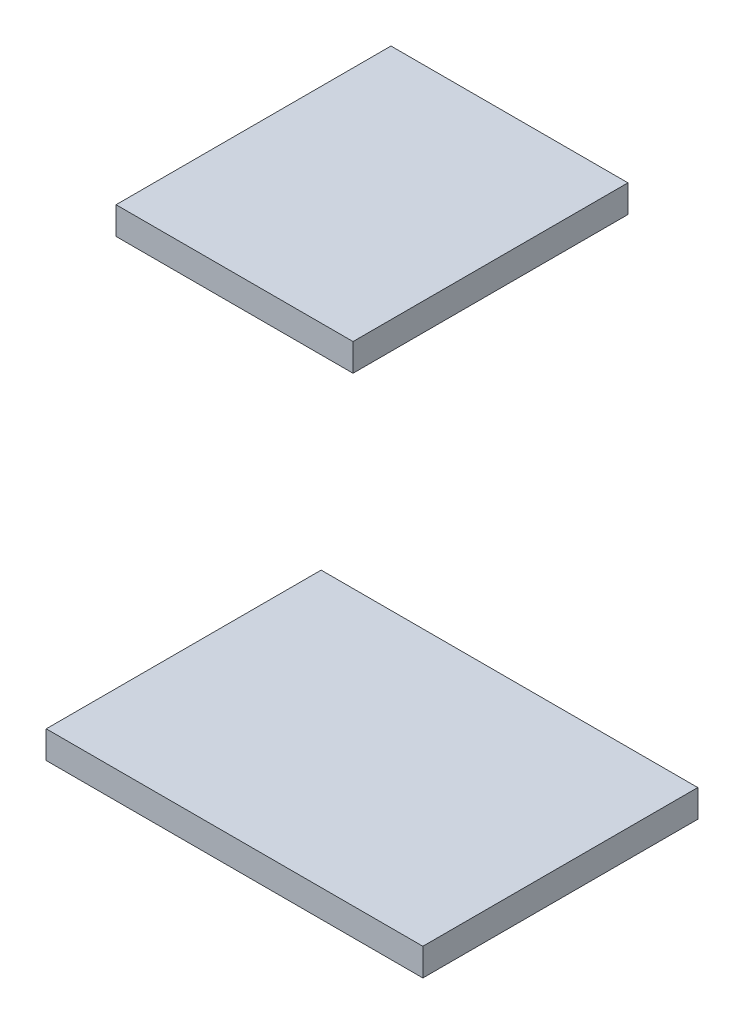
ISO-10303-21;
HEADER;
FILE_DESCRIPTION(('STEP AP214'),'2;1');
FILE_NAME('part.step','',(''),(''),'','','');
FILE_SCHEMA(('AUTOMOTIVE_DESIGN { 1 0 10303 214 1 1 1 1 }'));
ENDSEC;
DATA;
#1=APPLICATION_CONTEXT('core data for automotive mechanical design processes');
#2=APPLICATION_PROTOCOL_DEFINITION('international standard','automotive_design',2000,#1);
#3=PRODUCT_CONTEXT('',#1,'mechanical');
#4=PRODUCT('Part','Part','',(#3));
#5=PRODUCT_RELATED_PRODUCT_CATEGORY('part','',(#4));
#6=PRODUCT_DEFINITION_FORMATION('','',#4);
#7=PRODUCT_DEFINITION_CONTEXT('part definition',#1,'design');
#8=PRODUCT_DEFINITION('design','',#6,#7);
#9=PRODUCT_DEFINITION_SHAPE('','',#8);
#10=(LENGTH_UNIT() NAMED_UNIT(*) SI_UNIT(.MILLI.,.METRE.));
#11=(NAMED_UNIT(*) PLANE_ANGLE_UNIT() SI_UNIT($,.RADIAN.));
#12=(NAMED_UNIT(*) SI_UNIT($,.STERADIAN.) SOLID_ANGLE_UNIT());
#13=UNCERTAINTY_MEASURE_WITH_UNIT(LENGTH_MEASURE(1.E-05),#10,'distance_accuracy_value','');
#14=(GEOMETRIC_REPRESENTATION_CONTEXT(3) GLOBAL_UNCERTAINTY_ASSIGNED_CONTEXT((#13)) GLOBAL_UNIT_ASSIGNED_CONTEXT((#10,
#11,#12)) REPRESENTATION_CONTEXT('',''));
#15=CARTESIAN_POINT('',(0.,0.,0.));
#16=DIRECTION('',(0.,0.,1.));
#17=DIRECTION('',(1.,0.,0.));
#18=AXIS2_PLACEMENT_3D('',#15,#16,#17);
#19=CARTESIAN_POINT('',(131.29,-50.36,10.));
#20=DIRECTION('',(1.,0.,0.));
#21=DIRECTION('',(0.,0.,-1.));
#22=AXIS2_PLACEMENT_3D('',#19,#20,#21);
#23=PLANE('',#22);
#24=DIRECTION('',(0.,-1.,0.));
#25=VECTOR('',#24,1.);
#26=CARTESIAN_POINT('',(131.29,-50.36,0.));
#27=LINE('',#26,#25);
#28=CARTESIAN_POINT('',(131.29,-50.36,0.));
#29=VERTEX_POINT('',#28);
#30=CARTESIAN_POINT('',(131.29,-51.36,0.));
#31=VERTEX_POINT('',#30);
#32=EDGE_CURVE('E12',#29,#31,#27,.T.);
#33=ORIENTED_EDGE('',*,*,#32,.T.);
#34=DIRECTION('',(0.,0.,-1.));
#35=VECTOR('',#34,1.);
#36=CARTESIAN_POINT('',(131.29,-51.36,10.));
#37=LINE('',#36,#35);
#38=CARTESIAN_POINT('',(131.29,-51.36,10.));
#39=VERTEX_POINT('',#38);
#40=EDGE_CURVE('E118',#39,#31,#37,.T.);
#41=ORIENTED_EDGE('',*,*,#40,.F.);
#42=DIRECTION('',(0.,-1.,0.));
#43=VECTOR('',#42,1.);
#44=CARTESIAN_POINT('',(131.29,-50.36,10.));
#45=LINE('',#44,#43);
#46=CARTESIAN_POINT('',(131.29,-50.36,10.));
#47=VERTEX_POINT('',#46);
#48=EDGE_CURVE('E51',#47,#39,#45,.T.);
#49=ORIENTED_EDGE('',*,*,#48,.F.);
#50=DIRECTION('',(0.,0.,-1.));
#51=VECTOR('',#50,1.);
#52=CARTESIAN_POINT('',(131.29,-50.36,10.));
#53=LINE('',#52,#51);
#54=EDGE_CURVE('E106',#47,#29,#53,.T.);
#55=ORIENTED_EDGE('',*,*,#54,.T.);
#56=EDGE_LOOP('',(#33,#41,#49,#55));
#57=FACE_BOUND('',#56,.T.);
#58=ADVANCED_FACE('F47',(#57),#23,.F.);
#59=CARTESIAN_POINT('',(131.29,-51.36,10.));
#60=DIRECTION('',(0.,1.,0.));
#61=DIRECTION('',(0.,0.,1.));
#62=AXIS2_PLACEMENT_3D('',#59,#60,#61);
#63=PLANE('',#62);
#64=DIRECTION('',(1.,0.,0.));
#65=VECTOR('',#64,1.);
#66=CARTESIAN_POINT('',(131.29,-51.36,0.));
#67=LINE('',#66,#65);
#68=CARTESIAN_POINT('',(144.99,-51.36,0.));
#69=VERTEX_POINT('',#68);
#70=EDGE_CURVE('E57',#31,#69,#67,.T.);
#71=ORIENTED_EDGE('',*,*,#70,.T.);
#72=DIRECTION('',(0.,0.,-1.));
#73=VECTOR('',#72,1.);
#74=CARTESIAN_POINT('',(144.99,-51.36,10.));
#75=LINE('',#74,#73);
#76=CARTESIAN_POINT('',(144.99,-51.36,10.));
#77=VERTEX_POINT('',#76);
#78=EDGE_CURVE('E102',#77,#69,#75,.T.);
#79=ORIENTED_EDGE('',*,*,#78,.F.);
#80=DIRECTION('',(1.,0.,0.));
#81=VECTOR('',#80,1.);
#82=CARTESIAN_POINT('',(131.29,-51.36,10.));
#83=LINE('',#82,#81);
#84=EDGE_CURVE('E81',#39,#77,#83,.T.);
#85=ORIENTED_EDGE('',*,*,#84,.F.);
#86=ORIENTED_EDGE('',*,*,#40,.T.);
#87=EDGE_LOOP('',(#71,#79,#85,#86));
#88=FACE_BOUND('',#87,.T.);
#89=ADVANCED_FACE('F121',(#88),#63,.F.);
#90=CARTESIAN_POINT('',(144.99,-50.36,10.));
#91=DIRECTION('',(-1.,0.,0.));
#92=DIRECTION('',(0.,0.,1.));
#93=AXIS2_PLACEMENT_3D('',#90,#91,#92);
#94=PLANE('',#93);
#95=DIRECTION('',(0.,1.,0.));
#96=VECTOR('',#95,1.);
#97=CARTESIAN_POINT('',(144.99,-50.36,0.));
#98=LINE('',#97,#96);
#99=CARTESIAN_POINT('',(144.99,-50.36,0.));
#100=VERTEX_POINT('',#99);
#101=EDGE_CURVE('E97',#69,#100,#98,.T.);
#102=ORIENTED_EDGE('',*,*,#101,.T.);
#103=DIRECTION('',(0.,0.,-1.));
#104=VECTOR('',#103,1.);
#105=CARTESIAN_POINT('',(144.99,-50.36,10.));
#106=LINE('',#105,#104);
#107=CARTESIAN_POINT('',(144.99,-50.36,10.));
#108=VERTEX_POINT('',#107);
#109=EDGE_CURVE('E100',#108,#100,#106,.T.);
#110=ORIENTED_EDGE('',*,*,#109,.F.);
#111=DIRECTION('',(0.,1.,0.));
#112=VECTOR('',#111,1.);
#113=CARTESIAN_POINT('',(144.99,-50.36,10.));
#114=LINE('',#113,#112);
#115=EDGE_CURVE('E114',#77,#108,#114,.T.);
#116=ORIENTED_EDGE('',*,*,#115,.F.);
#117=ORIENTED_EDGE('',*,*,#78,.T.);
#118=EDGE_LOOP('',(#102,#110,#116,#117));
#119=FACE_BOUND('',#118,.T.);
#120=ADVANCED_FACE('F98',(#119),#94,.F.);
#121=CARTESIAN_POINT('',(131.29,-50.36,10.));
#122=DIRECTION('',(0.,-1.,0.));
#123=DIRECTION('',(0.,0.,-1.));
#124=AXIS2_PLACEMENT_3D('',#121,#122,#123);
#125=PLANE('',#124);
#126=DIRECTION('',(-1.,0.,0.));
#127=VECTOR('',#126,1.);
#128=CARTESIAN_POINT('',(131.29,-50.36,0.));
#129=LINE('',#128,#127);
#130=EDGE_CURVE('E91',#100,#29,#129,.T.);
#131=ORIENTED_EDGE('',*,*,#130,.T.);
#132=ORIENTED_EDGE('',*,*,#54,.F.);
#133=DIRECTION('',(-1.,0.,0.));
#134=VECTOR('',#133,1.);
#135=CARTESIAN_POINT('',(131.29,-50.36,10.));
#136=LINE('',#135,#134);
#137=EDGE_CURVE('E105',#108,#47,#136,.T.);
#138=ORIENTED_EDGE('',*,*,#137,.F.);
#139=ORIENTED_EDGE('',*,*,#109,.T.);
#140=EDGE_LOOP('',(#131,#132,#138,#139));
#141=FACE_BOUND('',#140,.T.);
#142=ADVANCED_FACE('F104',(#141),#125,.F.);
#143=CARTESIAN_POINT('',(0.,0.,10.));
#144=DIRECTION('',(0.,0.,1.));
#145=DIRECTION('',(1.,0.,0.));
#146=AXIS2_PLACEMENT_3D('',#143,#144,#145);
#147=PLANE('',#146);
#148=ORIENTED_EDGE('',*,*,#48,.T.);
#149=ORIENTED_EDGE('',*,*,#84,.T.);
#150=ORIENTED_EDGE('',*,*,#115,.T.);
#151=ORIENTED_EDGE('',*,*,#137,.T.);
#152=EDGE_LOOP('',(#148,#149,#150,#151));
#153=FACE_BOUND('',#152,.T.);
#154=ADVANCED_FACE('F49',(#153),#147,.T.);
#155=CARTESIAN_POINT('',(0.,0.,0.));
#156=DIRECTION('',(0.,0.,1.));
#157=DIRECTION('',(1.,0.,0.));
#158=AXIS2_PLACEMENT_3D('',#155,#156,#157);
#159=PLANE('',#158);
#160=ORIENTED_EDGE('',*,*,#32,.F.);
#161=ORIENTED_EDGE('',*,*,#130,.F.);
#162=ORIENTED_EDGE('',*,*,#101,.F.);
#163=ORIENTED_EDGE('',*,*,#70,.F.);
#164=EDGE_LOOP('',(#160,#161,#162,#163));
#165=FACE_BOUND('',#164,.T.);
#166=ADVANCED_FACE('F108',(#165),#159,.F.);
#167=CLOSED_SHELL('',(#58,#89,#120,#142,#154,#166));
#168=MANIFOLD_SOLID_BREP('B2',#167);
#169=CARTESIAN_POINT('',(133.83,-32.58,10.));
#170=DIRECTION('',(1.,0.,0.));
#171=DIRECTION('',(0.,0.,-1.));
#172=AXIS2_PLACEMENT_3D('',#169,#170,#171);
#173=PLANE('',#172);
#174=DIRECTION('',(0.,-1.,0.));
#175=VECTOR('',#174,1.);
#176=CARTESIAN_POINT('',(133.83,-32.58,0.));
#177=LINE('',#176,#175);
#178=CARTESIAN_POINT('',(133.83,-32.58,0.));
#179=VERTEX_POINT('',#178);
#180=CARTESIAN_POINT('',(133.83,-33.58,0.));
#181=VERTEX_POINT('',#180);
#182=EDGE_CURVE('E246',#179,#181,#177,.T.);
#183=ORIENTED_EDGE('',*,*,#182,.T.);
#184=DIRECTION('',(0.,0.,-1.));
#185=VECTOR('',#184,1.);
#186=CARTESIAN_POINT('',(133.83,-33.58,10.));
#187=LINE('',#186,#185);
#188=CARTESIAN_POINT('',(133.83,-33.58,10.));
#189=VERTEX_POINT('',#188);
#190=EDGE_CURVE('E45',#189,#181,#187,.T.);
#191=ORIENTED_EDGE('',*,*,#190,.F.);
#192=DIRECTION('',(0.,-1.,0.));
#193=VECTOR('',#192,1.);
#194=CARTESIAN_POINT('',(133.83,-32.58,10.));
#195=LINE('',#194,#193);
#196=CARTESIAN_POINT('',(133.83,-32.58,10.));
#197=VERTEX_POINT('',#196);
#198=EDGE_CURVE('E234',#197,#189,#195,.T.);
#199=ORIENTED_EDGE('',*,*,#198,.F.);
#200=DIRECTION('',(0.,0.,-1.));
#201=VECTOR('',#200,1.);
#202=CARTESIAN_POINT('',(133.83,-32.58,10.));
#203=LINE('',#202,#201);
#204=EDGE_CURVE('E242',#197,#179,#203,.T.);
#205=ORIENTED_EDGE('',*,*,#204,.T.);
#206=EDGE_LOOP('',(#183,#191,#199,#205));
#207=FACE_BOUND('',#206,.T.);
#208=ADVANCED_FACE('F183',(#207),#173,.F.);
#209=CARTESIAN_POINT('',(133.83,-33.58,10.));
#210=DIRECTION('',(0.,1.,0.));
#211=DIRECTION('',(0.,0.,1.));
#212=AXIS2_PLACEMENT_3D('',#209,#210,#211);
#213=PLANE('',#212);
#214=DIRECTION('',(1.,0.,0.));
#215=VECTOR('',#214,1.);
#216=CARTESIAN_POINT('',(133.83,-33.58,0.));
#217=LINE('',#216,#215);
#218=CARTESIAN_POINT('',(142.45,-33.58,0.));
#219=VERTEX_POINT('',#218);
#220=EDGE_CURVE('E238',#181,#219,#217,.T.);
#221=ORIENTED_EDGE('',*,*,#220,.T.);
#222=DIRECTION('',(0.,0.,-1.));
#223=VECTOR('',#222,1.);
#224=CARTESIAN_POINT('',(142.45,-33.58,10.));
#225=LINE('',#224,#223);
#226=CARTESIAN_POINT('',(142.45,-33.58,10.));
#227=VERTEX_POINT('',#226);
#228=EDGE_CURVE('E191',#227,#219,#225,.T.);
#229=ORIENTED_EDGE('',*,*,#228,.F.);
#230=DIRECTION('',(1.,0.,0.));
#231=VECTOR('',#230,1.);
#232=CARTESIAN_POINT('',(133.83,-33.58,10.));
#233=LINE('',#232,#231);
#234=EDGE_CURVE('E229',#189,#227,#233,.T.);
#235=ORIENTED_EDGE('',*,*,#234,.F.);
#236=ORIENTED_EDGE('',*,*,#190,.T.);
#237=EDGE_LOOP('',(#221,#229,#235,#236));
#238=FACE_BOUND('',#237,.T.);
#239=ADVANCED_FACE('F237',(#238),#213,.F.);
#240=CARTESIAN_POINT('',(142.45,-32.58,10.));
#241=DIRECTION('',(-1.,0.,0.));
#242=DIRECTION('',(0.,0.,1.));
#243=AXIS2_PLACEMENT_3D('',#240,#241,#242);
#244=PLANE('',#243);
#245=DIRECTION('',(0.,1.,0.));
#246=VECTOR('',#245,1.);
#247=CARTESIAN_POINT('',(142.45,-32.58,0.));
#248=LINE('',#247,#246);
#249=CARTESIAN_POINT('',(142.45,-32.58,0.));
#250=VERTEX_POINT('',#249);
#251=EDGE_CURVE('E216',#219,#250,#248,.T.);
#252=ORIENTED_EDGE('',*,*,#251,.T.);
#253=DIRECTION('',(0.,0.,-1.));
#254=VECTOR('',#253,1.);
#255=CARTESIAN_POINT('',(142.45,-32.58,10.));
#256=LINE('',#255,#254);
#257=CARTESIAN_POINT('',(142.45,-32.58,10.));
#258=VERTEX_POINT('',#257);
#259=EDGE_CURVE('E239',#258,#250,#256,.T.);
#260=ORIENTED_EDGE('',*,*,#259,.F.);
#261=DIRECTION('',(0.,1.,0.));
#262=VECTOR('',#261,1.);
#263=CARTESIAN_POINT('',(142.45,-32.58,10.));
#264=LINE('',#263,#262);
#265=EDGE_CURVE('E232',#227,#258,#264,.T.);
#266=ORIENTED_EDGE('',*,*,#265,.F.);
#267=ORIENTED_EDGE('',*,*,#228,.T.);
#268=EDGE_LOOP('',(#252,#260,#266,#267));
#269=FACE_BOUND('',#268,.T.);
#270=ADVANCED_FACE('F240',(#269),#244,.F.);
#271=CARTESIAN_POINT('',(133.83,-32.58,10.));
#272=DIRECTION('',(0.,-1.,0.));
#273=DIRECTION('',(0.,0.,-1.));
#274=AXIS2_PLACEMENT_3D('',#271,#272,#273);
#275=PLANE('',#274);
#276=DIRECTION('',(-1.,0.,0.));
#277=VECTOR('',#276,1.);
#278=CARTESIAN_POINT('',(133.83,-32.58,0.));
#279=LINE('',#278,#277);
#280=EDGE_CURVE('E222',#250,#179,#279,.T.);
#281=ORIENTED_EDGE('',*,*,#280,.T.);
#282=ORIENTED_EDGE('',*,*,#204,.F.);
#283=DIRECTION('',(-1.,0.,0.));
#284=VECTOR('',#283,1.);
#285=CARTESIAN_POINT('',(133.83,-32.58,10.));
#286=LINE('',#285,#284);
#287=EDGE_CURVE('E199',#258,#197,#286,.T.);
#288=ORIENTED_EDGE('',*,*,#287,.F.);
#289=ORIENTED_EDGE('',*,*,#259,.T.);
#290=EDGE_LOOP('',(#281,#282,#288,#289));
#291=FACE_BOUND('',#290,.T.);
#292=ADVANCED_FACE('F253',(#291),#275,.F.);
#293=CARTESIAN_POINT('',(0.,0.,10.));
#294=DIRECTION('',(0.,0.,1.));
#295=DIRECTION('',(1.,0.,0.));
#296=AXIS2_PLACEMENT_3D('',#293,#294,#295);
#297=PLANE('',#296);
#298=ORIENTED_EDGE('',*,*,#198,.T.);
#299=ORIENTED_EDGE('',*,*,#234,.T.);
#300=ORIENTED_EDGE('',*,*,#265,.T.);
#301=ORIENTED_EDGE('',*,*,#287,.T.);
#302=EDGE_LOOP('',(#298,#299,#300,#301));
#303=FACE_BOUND('',#302,.T.);
#304=ADVANCED_FACE('F230',(#303),#297,.T.);
#305=CARTESIAN_POINT('',(0.,0.,0.));
#306=DIRECTION('',(0.,0.,1.));
#307=DIRECTION('',(1.,0.,0.));
#308=AXIS2_PLACEMENT_3D('',#305,#306,#307);
#309=PLANE('',#308);
#310=ORIENTED_EDGE('',*,*,#182,.F.);
#311=ORIENTED_EDGE('',*,*,#280,.F.);
#312=ORIENTED_EDGE('',*,*,#251,.F.);
#313=ORIENTED_EDGE('',*,*,#220,.F.);
#314=EDGE_LOOP('',(#310,#311,#312,#313));
#315=FACE_BOUND('',#314,.T.);
#316=ADVANCED_FACE('F256',(#315),#309,.F.);
#317=CLOSED_SHELL('',(#208,#239,#270,#292,#304,#316));
#318=MANIFOLD_SOLID_BREP('B6',#317);
#319=ADVANCED_BREP_SHAPE_REPRESENTATION('',(#18,#168,#318),#14);
#320=SHAPE_DEFINITION_REPRESENTATION(#9,#319);
ENDSEC;
END-ISO-10303-21;
